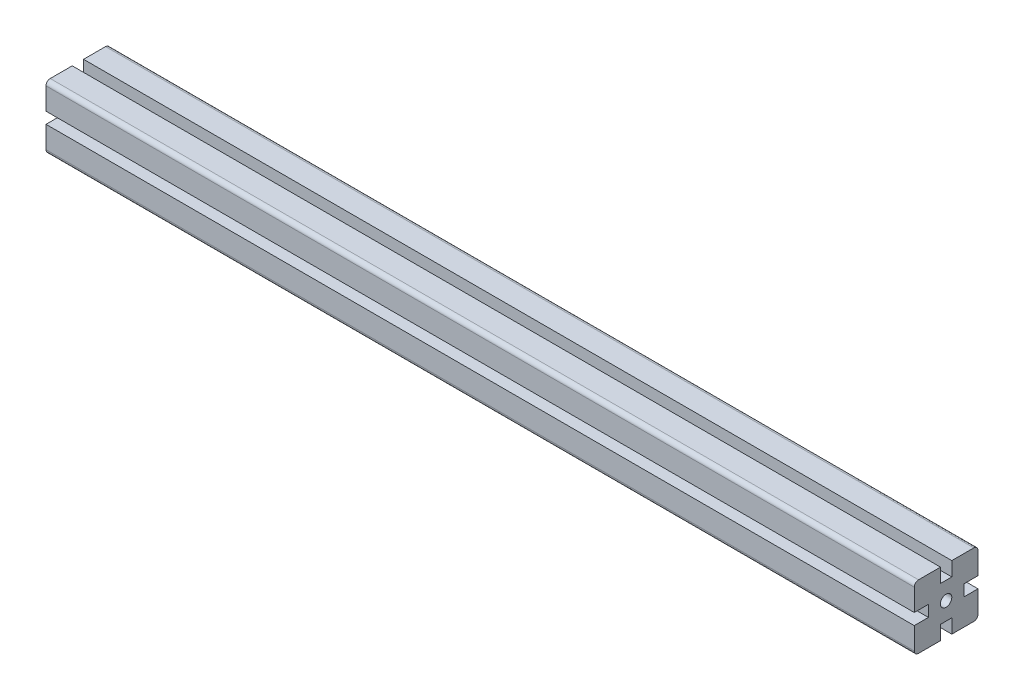
ISO-10303-21;
HEADER;
FILE_DESCRIPTION(('STEP AP214'),'2;1');
FILE_NAME('part.step','',(''),(''),'','','');
FILE_SCHEMA(('AUTOMOTIVE_DESIGN { 1 0 10303 214 1 1 1 1 }'));
ENDSEC;
DATA;
#1=APPLICATION_CONTEXT('core data for automotive mechanical design processes');
#2=APPLICATION_PROTOCOL_DEFINITION('international standard','automotive_design',2000,#1);
#3=PRODUCT_CONTEXT('',#1,'mechanical');
#4=PRODUCT('Part','Part','',(#3));
#5=PRODUCT_RELATED_PRODUCT_CATEGORY('part','',(#4));
#6=PRODUCT_DEFINITION_FORMATION('','',#4);
#7=PRODUCT_DEFINITION_CONTEXT('part definition',#1,'design');
#8=PRODUCT_DEFINITION('design','',#6,#7);
#9=PRODUCT_DEFINITION_SHAPE('','',#8);
#10=(LENGTH_UNIT() NAMED_UNIT(*) SI_UNIT(.MILLI.,.METRE.));
#11=(NAMED_UNIT(*) PLANE_ANGLE_UNIT() SI_UNIT($,.RADIAN.));
#12=(NAMED_UNIT(*) SI_UNIT($,.STERADIAN.) SOLID_ANGLE_UNIT());
#13=UNCERTAINTY_MEASURE_WITH_UNIT(LENGTH_MEASURE(1.E-05),#10,'distance_accuracy_value','');
#14=(GEOMETRIC_REPRESENTATION_CONTEXT(3) GLOBAL_UNCERTAINTY_ASSIGNED_CONTEXT((#13)) GLOBAL_UNIT_ASSIGNED_CONTEXT((#10,
#11,#12)) REPRESENTATION_CONTEXT('',''));
#15=CARTESIAN_POINT('',(0.,0.,0.));
#16=DIRECTION('',(0.,0.,1.));
#17=DIRECTION('',(1.,0.,0.));
#18=AXIS2_PLACEMENT_3D('',#15,#16,#17);
#19=CARTESIAN_POINT('',(387.,-22.5,-22.5));
#20=DIRECTION('',(0.,0.,-1.));
#21=DIRECTION('',(0.,1.,0.));
#22=AXIS2_PLACEMENT_3D('',#19,#20,#21);
#23=PLANE('',#22);
#24=DIRECTION('',(0.,1.,0.));
#25=VECTOR('',#24,1.);
#26=CARTESIAN_POINT('',(1000.,-22.5,-22.5));
#27=LINE('',#26,#25);
#28=CARTESIAN_POINT('',(1000.,-19.5,-22.5));
#29=VERTEX_POINT('',#28);
#30=CARTESIAN_POINT('',(1000.,-4.,-22.5));
#31=VERTEX_POINT('',#30);
#32=EDGE_CURVE('E269',#29,#31,#27,.T.);
#33=ORIENTED_EDGE('',*,*,#32,.F.);
#34=DIRECTION('',(1.,0.,0.));
#35=VECTOR('',#34,1.);
#36=CARTESIAN_POINT('',(387.,-19.5,-22.5));
#37=LINE('',#36,#35);
#38=CARTESIAN_POINT('',(387.,-19.5,-22.5));
#39=VERTEX_POINT('',#38);
#40=EDGE_CURVE('E200',#29,#39,#37,.F.);
#41=ORIENTED_EDGE('',*,*,#40,.T.);
#42=DIRECTION('',(0.,1.,0.));
#43=VECTOR('',#42,1.);
#44=CARTESIAN_POINT('',(387.,-22.5,-22.5));
#45=LINE('',#44,#43);
#46=CARTESIAN_POINT('',(387.,-4.,-22.5));
#47=VERTEX_POINT('',#46);
#48=EDGE_CURVE('E194',#39,#47,#45,.T.);
#49=ORIENTED_EDGE('',*,*,#48,.T.);
#50=DIRECTION('',(1.,0.,0.));
#51=VECTOR('',#50,1.);
#52=CARTESIAN_POINT('',(387.,-4.,-22.5));
#53=LINE('',#52,#51);
#54=EDGE_CURVE('E197',#47,#31,#53,.T.);
#55=ORIENTED_EDGE('',*,*,#54,.T.);
#56=EDGE_LOOP('',(#33,#41,#49,#55));
#57=FACE_BOUND('',#56,.T.);
#58=ADVANCED_FACE('F33',(#57),#23,.T.);
#59=CARTESIAN_POINT('',(387.,-22.5,-4.00000000000001));
#60=DIRECTION('',(0.,-1.,0.));
#61=DIRECTION('',(0.,0.,-1.));
#62=AXIS2_PLACEMENT_3D('',#59,#60,#61);
#63=PLANE('',#62);
#64=DIRECTION('',(0.,0.,-1.));
#65=VECTOR('',#64,1.);
#66=CARTESIAN_POINT('',(387.,-22.5,-4.00000000000001));
#67=LINE('',#66,#65);
#68=CARTESIAN_POINT('',(387.,-22.5,-4.00000000000001));
#69=VERTEX_POINT('',#68);
#70=CARTESIAN_POINT('',(387.,-22.5,-19.5));
#71=VERTEX_POINT('',#70);
#72=EDGE_CURVE('E212',#69,#71,#67,.T.);
#73=ORIENTED_EDGE('',*,*,#72,.T.);
#74=DIRECTION('',(1.,0.,0.));
#75=VECTOR('',#74,1.);
#76=CARTESIAN_POINT('',(387.,-22.5,-19.5));
#77=LINE('',#76,#75);
#78=CARTESIAN_POINT('',(1000.,-22.5,-19.5));
#79=VERTEX_POINT('',#78);
#80=EDGE_CURVE('E325',#71,#79,#77,.T.);
#81=ORIENTED_EDGE('',*,*,#80,.T.);
#82=DIRECTION('',(0.,0.,-1.));
#83=VECTOR('',#82,1.);
#84=CARTESIAN_POINT('',(1000.,-22.5,-4.00000000000001));
#85=LINE('',#84,#83);
#86=CARTESIAN_POINT('',(1000.,-22.5,-4.00000000000001));
#87=VERTEX_POINT('',#86);
#88=EDGE_CURVE('E204',#87,#79,#85,.T.);
#89=ORIENTED_EDGE('',*,*,#88,.F.);
#90=DIRECTION('',(1.,0.,0.));
#91=VECTOR('',#90,1.);
#92=CARTESIAN_POINT('',(387.,-22.5,-4.00000000000001));
#93=LINE('',#92,#91);
#94=EDGE_CURVE('E323',#69,#87,#93,.T.);
#95=ORIENTED_EDGE('',*,*,#94,.F.);
#96=EDGE_LOOP('',(#73,#81,#89,#95));
#97=FACE_BOUND('',#96,.T.);
#98=ADVANCED_FACE('F403',(#97),#63,.T.);
#99=CARTESIAN_POINT('',(387.,-12.5,-4.));
#100=DIRECTION('',(0.,0.,1.));
#101=DIRECTION('',(0.,-1.,0.));
#102=AXIS2_PLACEMENT_3D('',#99,#100,#101);
#103=PLANE('',#102);
#104=DIRECTION('',(0.,-1.,0.));
#105=VECTOR('',#104,1.);
#106=CARTESIAN_POINT('',(1000.,-12.5,-4.));
#107=LINE('',#106,#105);
#108=CARTESIAN_POINT('',(1000.,-12.5,-4.));
#109=VERTEX_POINT('',#108);
#110=EDGE_CURVE('E318',#109,#87,#107,.T.);
#111=ORIENTED_EDGE('',*,*,#110,.F.);
#112=DIRECTION('',(1.,0.,0.));
#113=VECTOR('',#112,1.);
#114=CARTESIAN_POINT('',(387.,-12.5,-4.));
#115=LINE('',#114,#113);
#116=CARTESIAN_POINT('',(387.,-12.5,-4.));
#117=VERTEX_POINT('',#116);
#118=EDGE_CURVE('E326',#117,#109,#115,.T.);
#119=ORIENTED_EDGE('',*,*,#118,.F.);
#120=DIRECTION('',(0.,-1.,0.));
#121=VECTOR('',#120,1.);
#122=CARTESIAN_POINT('',(387.,-12.5,-4.));
#123=LINE('',#122,#121);
#124=EDGE_CURVE('E264',#117,#69,#123,.T.);
#125=ORIENTED_EDGE('',*,*,#124,.T.);
#126=ORIENTED_EDGE('',*,*,#94,.T.);
#127=EDGE_LOOP('',(#111,#119,#125,#126));
#128=FACE_BOUND('',#127,.T.);
#129=ADVANCED_FACE('F407',(#128),#103,.T.);
#130=CARTESIAN_POINT('',(387.,-12.5,4.));
#131=DIRECTION('',(0.,-1.,0.));
#132=DIRECTION('',(0.,0.,-1.));
#133=AXIS2_PLACEMENT_3D('',#130,#131,#132);
#134=PLANE('',#133);
#135=DIRECTION('',(0.,0.,-1.));
#136=VECTOR('',#135,1.);
#137=CARTESIAN_POINT('',(1000.,-12.5,4.));
#138=LINE('',#137,#136);
#139=CARTESIAN_POINT('',(1000.,-12.5,4.));
#140=VERTEX_POINT('',#139);
#141=EDGE_CURVE('E315',#140,#109,#138,.T.);
#142=ORIENTED_EDGE('',*,*,#141,.F.);
#143=DIRECTION('',(1.,0.,0.));
#144=VECTOR('',#143,1.);
#145=CARTESIAN_POINT('',(387.,-12.5,4.));
#146=LINE('',#145,#144);
#147=CARTESIAN_POINT('',(387.,-12.5,4.));
#148=VERTEX_POINT('',#147);
#149=EDGE_CURVE('E328',#148,#140,#146,.T.);
#150=ORIENTED_EDGE('',*,*,#149,.F.);
#151=DIRECTION('',(0.,0.,-1.));
#152=VECTOR('',#151,1.);
#153=CARTESIAN_POINT('',(387.,-12.5,4.));
#154=LINE('',#153,#152);
#155=EDGE_CURVE('E261',#148,#117,#154,.T.);
#156=ORIENTED_EDGE('',*,*,#155,.T.);
#157=ORIENTED_EDGE('',*,*,#118,.T.);
#158=EDGE_LOOP('',(#142,#150,#156,#157));
#159=FACE_BOUND('',#158,.T.);
#160=ADVANCED_FACE('F412',(#159),#134,.T.);
#161=CARTESIAN_POINT('',(387.,-22.5,4.00000000000001));
#162=DIRECTION('',(0.,0.,-1.));
#163=DIRECTION('',(0.,1.,0.));
#164=AXIS2_PLACEMENT_3D('',#161,#162,#163);
#165=PLANE('',#164);
#166=DIRECTION('',(0.,1.,0.));
#167=VECTOR('',#166,1.);
#168=CARTESIAN_POINT('',(1000.,-22.5,4.00000000000001));
#169=LINE('',#168,#167);
#170=CARTESIAN_POINT('',(1000.,-22.5,4.00000000000001));
#171=VERTEX_POINT('',#170);
#172=EDGE_CURVE('E312',#171,#140,#169,.T.);
#173=ORIENTED_EDGE('',*,*,#172,.F.);
#174=DIRECTION('',(1.,0.,0.));
#175=VECTOR('',#174,1.);
#176=CARTESIAN_POINT('',(387.,-22.5,4.00000000000001));
#177=LINE('',#176,#175);
#178=CARTESIAN_POINT('',(387.,-22.5,4.00000000000001));
#179=VERTEX_POINT('',#178);
#180=EDGE_CURVE('E330',#179,#171,#177,.T.);
#181=ORIENTED_EDGE('',*,*,#180,.F.);
#182=DIRECTION('',(0.,1.,0.));
#183=VECTOR('',#182,1.);
#184=CARTESIAN_POINT('',(387.,-22.5,4.00000000000001));
#185=LINE('',#184,#183);
#186=EDGE_CURVE('E258',#179,#148,#185,.T.);
#187=ORIENTED_EDGE('',*,*,#186,.T.);
#188=ORIENTED_EDGE('',*,*,#149,.T.);
#189=EDGE_LOOP('',(#173,#181,#187,#188));
#190=FACE_BOUND('',#189,.T.);
#191=ADVANCED_FACE('F415',(#190),#165,.T.);
#192=CARTESIAN_POINT('',(387.,-22.5,22.5));
#193=DIRECTION('',(0.,-1.,0.));
#194=DIRECTION('',(0.,0.,-1.));
#195=AXIS2_PLACEMENT_3D('',#192,#193,#194);
#196=PLANE('',#195);
#197=DIRECTION('',(0.,0.,-1.));
#198=VECTOR('',#197,1.);
#199=CARTESIAN_POINT('',(1000.,-22.5,22.5));
#200=LINE('',#199,#198);
#201=CARTESIAN_POINT('',(1000.,-22.5,19.5));
#202=VERTEX_POINT('',#201);
#203=EDGE_CURVE('E310',#202,#171,#200,.T.);
#204=ORIENTED_EDGE('',*,*,#203,.F.);
#205=DIRECTION('',(1.,0.,0.));
#206=VECTOR('',#205,1.);
#207=CARTESIAN_POINT('',(387.,-22.5,19.5));
#208=LINE('',#207,#206);
#209=CARTESIAN_POINT('',(387.,-22.5,19.5));
#210=VERTEX_POINT('',#209);
#211=EDGE_CURVE('E377',#202,#210,#208,.F.);
#212=ORIENTED_EDGE('',*,*,#211,.T.);
#213=DIRECTION('',(0.,0.,-1.));
#214=VECTOR('',#213,1.);
#215=CARTESIAN_POINT('',(387.,-22.5,22.5));
#216=LINE('',#215,#214);
#217=EDGE_CURVE('E256',#210,#179,#216,.T.);
#218=ORIENTED_EDGE('',*,*,#217,.T.);
#219=ORIENTED_EDGE('',*,*,#180,.T.);
#220=EDGE_LOOP('',(#204,#212,#218,#219));
#221=FACE_BOUND('',#220,.T.);
#222=ADVANCED_FACE('F628',(#221),#196,.T.);
#223=CARTESIAN_POINT('',(387.,-4.,22.5));
#224=DIRECTION('',(0.,0.,1.));
#225=DIRECTION('',(0.,-1.,0.));
#226=AXIS2_PLACEMENT_3D('',#223,#224,#225);
#227=PLANE('',#226);
#228=DIRECTION('',(0.,-1.,0.));
#229=VECTOR('',#228,1.);
#230=CARTESIAN_POINT('',(387.,-4.,22.5));
#231=LINE('',#230,#229);
#232=CARTESIAN_POINT('',(387.,-4.,22.5));
#233=VERTEX_POINT('',#232);
#234=CARTESIAN_POINT('',(387.,-19.5,22.5));
#235=VERTEX_POINT('',#234);
#236=EDGE_CURVE('E253',#233,#235,#231,.T.);
#237=ORIENTED_EDGE('',*,*,#236,.T.);
#238=DIRECTION('',(1.,0.,0.));
#239=VECTOR('',#238,1.);
#240=CARTESIAN_POINT('',(387.,-19.5,22.5));
#241=LINE('',#240,#239);
#242=CARTESIAN_POINT('',(1000.,-19.5,22.5));
#243=VERTEX_POINT('',#242);
#244=EDGE_CURVE('E374',#235,#243,#241,.T.);
#245=ORIENTED_EDGE('',*,*,#244,.T.);
#246=DIRECTION('',(0.,-1.,0.));
#247=VECTOR('',#246,1.);
#248=CARTESIAN_POINT('',(1000.,-4.,22.5));
#249=LINE('',#248,#247);
#250=CARTESIAN_POINT('',(1000.,-4.,22.5));
#251=VERTEX_POINT('',#250);
#252=EDGE_CURVE('E307',#251,#243,#249,.T.);
#253=ORIENTED_EDGE('',*,*,#252,.F.);
#254=DIRECTION('',(1.,0.,0.));
#255=VECTOR('',#254,1.);
#256=CARTESIAN_POINT('',(387.,-4.,22.5));
#257=LINE('',#256,#255);
#258=EDGE_CURVE('E333',#233,#251,#257,.T.);
#259=ORIENTED_EDGE('',*,*,#258,.F.);
#260=EDGE_LOOP('',(#237,#245,#253,#259));
#261=FACE_BOUND('',#260,.T.);
#262=ADVANCED_FACE('F427',(#261),#227,.T.);
#263=CARTESIAN_POINT('',(387.,-4.,12.5));
#264=DIRECTION('',(0.,1.,0.));
#265=DIRECTION('',(0.,0.,1.));
#266=AXIS2_PLACEMENT_3D('',#263,#264,#265);
#267=PLANE('',#266);
#268=DIRECTION('',(0.,0.,1.));
#269=VECTOR('',#268,1.);
#270=CARTESIAN_POINT('',(1000.,-4.,12.5));
#271=LINE('',#270,#269);
#272=CARTESIAN_POINT('',(1000.,-4.,12.5));
#273=VERTEX_POINT('',#272);
#274=EDGE_CURVE('E304',#273,#251,#271,.T.);
#275=ORIENTED_EDGE('',*,*,#274,.F.);
#276=DIRECTION('',(1.,0.,0.));
#277=VECTOR('',#276,1.);
#278=CARTESIAN_POINT('',(387.,-4.,12.5));
#279=LINE('',#278,#277);
#280=CARTESIAN_POINT('',(387.,-4.,12.5));
#281=VERTEX_POINT('',#280);
#282=EDGE_CURVE('E335',#281,#273,#279,.T.);
#283=ORIENTED_EDGE('',*,*,#282,.F.);
#284=DIRECTION('',(0.,0.,1.));
#285=VECTOR('',#284,1.);
#286=CARTESIAN_POINT('',(387.,-4.,12.5));
#287=LINE('',#286,#285);
#288=EDGE_CURVE('E250',#281,#233,#287,.T.);
#289=ORIENTED_EDGE('',*,*,#288,.T.);
#290=ORIENTED_EDGE('',*,*,#258,.T.);
#291=EDGE_LOOP('',(#275,#283,#289,#290));
#292=FACE_BOUND('',#291,.T.);
#293=ADVANCED_FACE('F432',(#292),#267,.T.);
#294=CARTESIAN_POINT('',(387.,4.,12.5));
#295=DIRECTION('',(0.,0.,1.));
#296=DIRECTION('',(1.,0.,0.));
#297=AXIS2_PLACEMENT_3D('',#294,#295,#296);
#298=PLANE('',#297);
#299=DIRECTION('',(0.,-1.,0.));
#300=VECTOR('',#299,1.);
#301=CARTESIAN_POINT('',(1000.,4.,12.5));
#302=LINE('',#301,#300);
#303=CARTESIAN_POINT('',(1000.,4.,12.5));
#304=VERTEX_POINT('',#303);
#305=EDGE_CURVE('E301',#304,#273,#302,.T.);
#306=ORIENTED_EDGE('',*,*,#305,.F.);
#307=DIRECTION('',(1.,0.,0.));
#308=VECTOR('',#307,1.);
#309=CARTESIAN_POINT('',(387.,4.,12.5));
#310=LINE('',#309,#308);
#311=CARTESIAN_POINT('',(387.,4.,12.5));
#312=VERTEX_POINT('',#311);
#313=EDGE_CURVE('E337',#312,#304,#310,.T.);
#314=ORIENTED_EDGE('',*,*,#313,.F.);
#315=DIRECTION('',(0.,-1.,0.));
#316=VECTOR('',#315,1.);
#317=CARTESIAN_POINT('',(387.,4.,12.5));
#318=LINE('',#317,#316);
#319=EDGE_CURVE('E247',#312,#281,#318,.T.);
#320=ORIENTED_EDGE('',*,*,#319,.T.);
#321=ORIENTED_EDGE('',*,*,#282,.T.);
#322=EDGE_LOOP('',(#306,#314,#320,#321));
#323=FACE_BOUND('',#322,.T.);
#324=ADVANCED_FACE('F437',(#323),#298,.T.);
#325=CARTESIAN_POINT('',(387.,4.,22.5));
#326=DIRECTION('',(0.,-1.,0.));
#327=DIRECTION('',(0.,0.,-1.));
#328=AXIS2_PLACEMENT_3D('',#325,#326,#327);
#329=PLANE('',#328);
#330=DIRECTION('',(0.,0.,-1.));
#331=VECTOR('',#330,1.);
#332=CARTESIAN_POINT('',(1000.,4.,22.5));
#333=LINE('',#332,#331);
#334=CARTESIAN_POINT('',(1000.,4.,22.5));
#335=VERTEX_POINT('',#334);
#336=EDGE_CURVE('E298',#335,#304,#333,.T.);
#337=ORIENTED_EDGE('',*,*,#336,.F.);
#338=DIRECTION('',(1.,0.,0.));
#339=VECTOR('',#338,1.);
#340=CARTESIAN_POINT('',(387.,4.,22.5));
#341=LINE('',#340,#339);
#342=CARTESIAN_POINT('',(387.,4.,22.5));
#343=VERTEX_POINT('',#342);
#344=EDGE_CURVE('E339',#343,#335,#341,.T.);
#345=ORIENTED_EDGE('',*,*,#344,.F.);
#346=DIRECTION('',(0.,0.,-1.));
#347=VECTOR('',#346,1.);
#348=CARTESIAN_POINT('',(387.,4.,22.5));
#349=LINE('',#348,#347);
#350=EDGE_CURVE('E244',#343,#312,#349,.T.);
#351=ORIENTED_EDGE('',*,*,#350,.T.);
#352=ORIENTED_EDGE('',*,*,#313,.T.);
#353=EDGE_LOOP('',(#337,#345,#351,#352));
#354=FACE_BOUND('',#353,.T.);
#355=ADVANCED_FACE('F440',(#354),#329,.T.);
#356=CARTESIAN_POINT('',(387.,22.5,22.5));
#357=DIRECTION('',(0.,0.,1.));
#358=DIRECTION('',(0.,-1.,0.));
#359=AXIS2_PLACEMENT_3D('',#356,#357,#358);
#360=PLANE('',#359);
#361=DIRECTION('',(0.,-1.,0.));
#362=VECTOR('',#361,1.);
#363=CARTESIAN_POINT('',(1000.,22.5,22.5));
#364=LINE('',#363,#362);
#365=CARTESIAN_POINT('',(1000.,19.5,22.5));
#366=VERTEX_POINT('',#365);
#367=EDGE_CURVE('E296',#366,#335,#364,.T.);
#368=ORIENTED_EDGE('',*,*,#367,.F.);
#369=DIRECTION('',(1.,0.,0.));
#370=VECTOR('',#369,1.);
#371=CARTESIAN_POINT('',(387.,19.5,22.5));
#372=LINE('',#371,#370);
#373=CARTESIAN_POINT('',(387.,19.5,22.5));
#374=VERTEX_POINT('',#373);
#375=EDGE_CURVE('E382',#366,#374,#372,.F.);
#376=ORIENTED_EDGE('',*,*,#375,.T.);
#377=DIRECTION('',(0.,-1.,0.));
#378=VECTOR('',#377,1.);
#379=CARTESIAN_POINT('',(387.,22.5,22.5));
#380=LINE('',#379,#378);
#381=EDGE_CURVE('E242',#374,#343,#380,.T.);
#382=ORIENTED_EDGE('',*,*,#381,.T.);
#383=ORIENTED_EDGE('',*,*,#344,.T.);
#384=EDGE_LOOP('',(#368,#376,#382,#383));
#385=FACE_BOUND('',#384,.T.);
#386=ADVANCED_FACE('F592',(#385),#360,.T.);
#387=CARTESIAN_POINT('',(387.,22.5,4.));
#388=DIRECTION('',(0.,1.,0.));
#389=DIRECTION('',(0.,0.,1.));
#390=AXIS2_PLACEMENT_3D('',#387,#388,#389);
#391=PLANE('',#390);
#392=DIRECTION('',(0.,0.,1.));
#393=VECTOR('',#392,1.);
#394=CARTESIAN_POINT('',(387.,22.5,4.));
#395=LINE('',#394,#393);
#396=CARTESIAN_POINT('',(387.,22.5,4.));
#397=VERTEX_POINT('',#396);
#398=CARTESIAN_POINT('',(387.,22.5,19.5));
#399=VERTEX_POINT('',#398);
#400=EDGE_CURVE('E239',#397,#399,#395,.T.);
#401=ORIENTED_EDGE('',*,*,#400,.T.);
#402=DIRECTION('',(1.,0.,0.));
#403=VECTOR('',#402,1.);
#404=CARTESIAN_POINT('',(387.,22.5,19.5));
#405=LINE('',#404,#403);
#406=CARTESIAN_POINT('',(1000.,22.5,19.5));
#407=VERTEX_POINT('',#406);
#408=EDGE_CURVE('E379',#399,#407,#405,.T.);
#409=ORIENTED_EDGE('',*,*,#408,.T.);
#410=DIRECTION('',(0.,0.,1.));
#411=VECTOR('',#410,1.);
#412=CARTESIAN_POINT('',(1000.,22.5,4.));
#413=LINE('',#412,#411);
#414=CARTESIAN_POINT('',(1000.,22.5,4.));
#415=VERTEX_POINT('',#414);
#416=EDGE_CURVE('E293',#415,#407,#413,.T.);
#417=ORIENTED_EDGE('',*,*,#416,.F.);
#418=DIRECTION('',(1.,0.,0.));
#419=VECTOR('',#418,1.);
#420=CARTESIAN_POINT('',(387.,22.5,4.));
#421=LINE('',#420,#419);
#422=EDGE_CURVE('E342',#397,#415,#421,.T.);
#423=ORIENTED_EDGE('',*,*,#422,.F.);
#424=EDGE_LOOP('',(#401,#409,#417,#423));
#425=FACE_BOUND('',#424,.T.);
#426=ADVANCED_FACE('F452',(#425),#391,.T.);
#427=CARTESIAN_POINT('',(387.,12.5,4.));
#428=DIRECTION('',(0.,0.,-1.));
#429=DIRECTION('',(0.,1.,0.));
#430=AXIS2_PLACEMENT_3D('',#427,#428,#429);
#431=PLANE('',#430);
#432=DIRECTION('',(0.,1.,0.));
#433=VECTOR('',#432,1.);
#434=CARTESIAN_POINT('',(1000.,12.5,4.));
#435=LINE('',#434,#433);
#436=CARTESIAN_POINT('',(1000.,12.5,4.));
#437=VERTEX_POINT('',#436);
#438=EDGE_CURVE('E290',#437,#415,#435,.T.);
#439=ORIENTED_EDGE('',*,*,#438,.F.);
#440=DIRECTION('',(1.,0.,0.));
#441=VECTOR('',#440,1.);
#442=CARTESIAN_POINT('',(387.,12.5,4.));
#443=LINE('',#442,#441);
#444=CARTESIAN_POINT('',(387.,12.5,4.));
#445=VERTEX_POINT('',#444);
#446=EDGE_CURVE('E344',#445,#437,#443,.T.);
#447=ORIENTED_EDGE('',*,*,#446,.F.);
#448=DIRECTION('',(0.,1.,0.));
#449=VECTOR('',#448,1.);
#450=CARTESIAN_POINT('',(387.,12.5,4.));
#451=LINE('',#450,#449);
#452=EDGE_CURVE('E236',#445,#397,#451,.T.);
#453=ORIENTED_EDGE('',*,*,#452,.T.);
#454=ORIENTED_EDGE('',*,*,#422,.T.);
#455=EDGE_LOOP('',(#439,#447,#453,#454));
#456=FACE_BOUND('',#455,.T.);
#457=ADVANCED_FACE('F457',(#456),#431,.T.);
#458=CARTESIAN_POINT('',(387.,12.5,-4.));
#459=DIRECTION('',(0.,1.,0.));
#460=DIRECTION('',(0.,0.,1.));
#461=AXIS2_PLACEMENT_3D('',#458,#459,#460);
#462=PLANE('',#461);
#463=DIRECTION('',(0.,0.,1.));
#464=VECTOR('',#463,1.);
#465=CARTESIAN_POINT('',(1000.,12.5,-4.));
#466=LINE('',#465,#464);
#467=CARTESIAN_POINT('',(1000.,12.5,-4.));
#468=VERTEX_POINT('',#467);
#469=EDGE_CURVE('E287',#468,#437,#466,.T.);
#470=ORIENTED_EDGE('',*,*,#469,.F.);
#471=DIRECTION('',(1.,0.,0.));
#472=VECTOR('',#471,1.);
#473=CARTESIAN_POINT('',(387.,12.5,-4.));
#474=LINE('',#473,#472);
#475=CARTESIAN_POINT('',(387.,12.5,-4.));
#476=VERTEX_POINT('',#475);
#477=EDGE_CURVE('E346',#476,#468,#474,.T.);
#478=ORIENTED_EDGE('',*,*,#477,.F.);
#479=DIRECTION('',(0.,0.,1.));
#480=VECTOR('',#479,1.);
#481=CARTESIAN_POINT('',(387.,12.5,-4.));
#482=LINE('',#481,#480);
#483=EDGE_CURVE('E233',#476,#445,#482,.T.);
#484=ORIENTED_EDGE('',*,*,#483,.T.);
#485=ORIENTED_EDGE('',*,*,#446,.T.);
#486=EDGE_LOOP('',(#470,#478,#484,#485));
#487=FACE_BOUND('',#486,.T.);
#488=ADVANCED_FACE('F462',(#487),#462,.T.);
#489=CARTESIAN_POINT('',(387.,22.5,-4.));
#490=DIRECTION('',(0.,0.,1.));
#491=DIRECTION('',(0.,-1.,0.));
#492=AXIS2_PLACEMENT_3D('',#489,#490,#491);
#493=PLANE('',#492);
#494=DIRECTION('',(0.,-1.,0.));
#495=VECTOR('',#494,1.);
#496=CARTESIAN_POINT('',(1000.,22.5,-4.));
#497=LINE('',#496,#495);
#498=CARTESIAN_POINT('',(1000.,22.5,-4.));
#499=VERTEX_POINT('',#498);
#500=EDGE_CURVE('E284',#499,#468,#497,.T.);
#501=ORIENTED_EDGE('',*,*,#500,.F.);
#502=DIRECTION('',(1.,0.,0.));
#503=VECTOR('',#502,1.);
#504=CARTESIAN_POINT('',(387.,22.5,-4.));
#505=LINE('',#504,#503);
#506=CARTESIAN_POINT('',(387.,22.5,-4.));
#507=VERTEX_POINT('',#506);
#508=EDGE_CURVE('E348',#507,#499,#505,.T.);
#509=ORIENTED_EDGE('',*,*,#508,.F.);
#510=DIRECTION('',(0.,-1.,0.));
#511=VECTOR('',#510,1.);
#512=CARTESIAN_POINT('',(387.,22.5,-4.));
#513=LINE('',#512,#511);
#514=EDGE_CURVE('E230',#507,#476,#513,.T.);
#515=ORIENTED_EDGE('',*,*,#514,.T.);
#516=ORIENTED_EDGE('',*,*,#477,.T.);
#517=EDGE_LOOP('',(#501,#509,#515,#516));
#518=FACE_BOUND('',#517,.T.);
#519=ADVANCED_FACE('F465',(#518),#493,.T.);
#520=CARTESIAN_POINT('',(387.,22.5,-22.5));
#521=DIRECTION('',(0.,1.,0.));
#522=DIRECTION('',(0.,0.,1.));
#523=AXIS2_PLACEMENT_3D('',#520,#521,#522);
#524=PLANE('',#523);
#525=DIRECTION('',(0.,0.,1.));
#526=VECTOR('',#525,1.);
#527=CARTESIAN_POINT('',(1000.,22.5,-22.5));
#528=LINE('',#527,#526);
#529=CARTESIAN_POINT('',(1000.,22.5,-19.5));
#530=VERTEX_POINT('',#529);
#531=EDGE_CURVE('E282',#530,#499,#528,.T.);
#532=ORIENTED_EDGE('',*,*,#531,.F.);
#533=DIRECTION('',(1.,0.,0.));
#534=VECTOR('',#533,1.);
#535=CARTESIAN_POINT('',(387.,22.5,-19.5));
#536=LINE('',#535,#534);
#537=CARTESIAN_POINT('',(387.,22.5,-19.5));
#538=VERTEX_POINT('',#537);
#539=EDGE_CURVE('E11',#530,#538,#536,.F.);
#540=ORIENTED_EDGE('',*,*,#539,.T.);
#541=DIRECTION('',(0.,0.,1.));
#542=VECTOR('',#541,1.);
#543=CARTESIAN_POINT('',(387.,22.5,-22.5));
#544=LINE('',#543,#542);
#545=EDGE_CURVE('E228',#538,#507,#544,.T.);
#546=ORIENTED_EDGE('',*,*,#545,.T.);
#547=ORIENTED_EDGE('',*,*,#508,.T.);
#548=EDGE_LOOP('',(#532,#540,#546,#547));
#549=FACE_BOUND('',#548,.T.);
#550=ADVANCED_FACE('F556',(#549),#524,.T.);
#551=CARTESIAN_POINT('',(387.,4.,-22.5));
#552=DIRECTION('',(0.,0.,-1.));
#553=DIRECTION('',(0.,1.,0.));
#554=AXIS2_PLACEMENT_3D('',#551,#552,#553);
#555=PLANE('',#554);
#556=DIRECTION('',(0.,1.,0.));
#557=VECTOR('',#556,1.);
#558=CARTESIAN_POINT('',(387.,4.,-22.5));
#559=LINE('',#558,#557);
#560=CARTESIAN_POINT('',(387.,4.,-22.5));
#561=VERTEX_POINT('',#560);
#562=CARTESIAN_POINT('',(387.,19.5,-22.5));
#563=VERTEX_POINT('',#562);
#564=EDGE_CURVE('E226',#561,#563,#559,.T.);
#565=ORIENTED_EDGE('',*,*,#564,.T.);
#566=DIRECTION('',(1.,0.,0.));
#567=VECTOR('',#566,1.);
#568=CARTESIAN_POINT('',(387.,19.5,-22.5));
#569=LINE('',#568,#567);
#570=CARTESIAN_POINT('',(1000.,19.5,-22.5));
#571=VERTEX_POINT('',#570);
#572=EDGE_CURVE('E41',#563,#571,#569,.T.);
#573=ORIENTED_EDGE('',*,*,#572,.T.);
#574=DIRECTION('',(0.,1.,0.));
#575=VECTOR('',#574,1.);
#576=CARTESIAN_POINT('',(1000.,4.,-22.5));
#577=LINE('',#576,#575);
#578=CARTESIAN_POINT('',(1000.,4.,-22.5));
#579=VERTEX_POINT('',#578);
#580=EDGE_CURVE('E279',#579,#571,#577,.T.);
#581=ORIENTED_EDGE('',*,*,#580,.F.);
#582=DIRECTION('',(1.,0.,0.));
#583=VECTOR('',#582,1.);
#584=CARTESIAN_POINT('',(387.,4.,-22.5));
#585=LINE('',#584,#583);
#586=EDGE_CURVE('E351',#561,#579,#585,.T.);
#587=ORIENTED_EDGE('',*,*,#586,.F.);
#588=EDGE_LOOP('',(#565,#573,#581,#587));
#589=FACE_BOUND('',#588,.T.);
#590=ADVANCED_FACE('F387',(#589),#555,.T.);
#591=CARTESIAN_POINT('',(387.,4.,-12.5));
#592=DIRECTION('',(0.,-1.,0.));
#593=DIRECTION('',(0.,0.,-1.));
#594=AXIS2_PLACEMENT_3D('',#591,#592,#593);
#595=PLANE('',#594);
#596=DIRECTION('',(0.,0.,-1.));
#597=VECTOR('',#596,1.);
#598=CARTESIAN_POINT('',(1000.,4.,-12.5));
#599=LINE('',#598,#597);
#600=CARTESIAN_POINT('',(1000.,4.,-12.5));
#601=VERTEX_POINT('',#600);
#602=EDGE_CURVE('E276',#601,#579,#599,.T.);
#603=ORIENTED_EDGE('',*,*,#602,.F.);
#604=DIRECTION('',(1.,0.,0.));
#605=VECTOR('',#604,1.);
#606=CARTESIAN_POINT('',(387.,4.,-12.5));
#607=LINE('',#606,#605);
#608=CARTESIAN_POINT('',(387.,4.,-12.5));
#609=VERTEX_POINT('',#608);
#610=EDGE_CURVE('E353',#609,#601,#607,.T.);
#611=ORIENTED_EDGE('',*,*,#610,.F.);
#612=DIRECTION('',(0.,0.,-1.));
#613=VECTOR('',#612,1.);
#614=CARTESIAN_POINT('',(387.,4.,-12.5));
#615=LINE('',#614,#613);
#616=EDGE_CURVE('E220',#609,#561,#615,.T.);
#617=ORIENTED_EDGE('',*,*,#616,.T.);
#618=ORIENTED_EDGE('',*,*,#586,.T.);
#619=EDGE_LOOP('',(#603,#611,#617,#618));
#620=FACE_BOUND('',#619,.T.);
#621=ADVANCED_FACE('F394',(#620),#595,.T.);
#622=CARTESIAN_POINT('',(387.,-4.,-12.5));
#623=DIRECTION('',(0.,0.,-1.));
#624=DIRECTION('',(-1.,0.,0.));
#625=AXIS2_PLACEMENT_3D('',#622,#623,#624);
#626=PLANE('',#625);
#627=DIRECTION('',(0.,1.,0.));
#628=VECTOR('',#627,1.);
#629=CARTESIAN_POINT('',(1000.,-4.,-12.5));
#630=LINE('',#629,#628);
#631=CARTESIAN_POINT('',(1000.,-4.,-12.5));
#632=VERTEX_POINT('',#631);
#633=EDGE_CURVE('E273',#632,#601,#630,.T.);
#634=ORIENTED_EDGE('',*,*,#633,.F.);
#635=DIRECTION('',(1.,0.,0.));
#636=VECTOR('',#635,1.);
#637=CARTESIAN_POINT('',(387.,-4.,-12.5));
#638=LINE('',#637,#636);
#639=CARTESIAN_POINT('',(387.,-4.,-12.5));
#640=VERTEX_POINT('',#639);
#641=EDGE_CURVE('E211',#640,#632,#638,.T.);
#642=ORIENTED_EDGE('',*,*,#641,.F.);
#643=DIRECTION('',(0.,1.,0.));
#644=VECTOR('',#643,1.);
#645=CARTESIAN_POINT('',(387.,-4.,-12.5));
#646=LINE('',#645,#644);
#647=EDGE_CURVE('E218',#640,#609,#646,.T.);
#648=ORIENTED_EDGE('',*,*,#647,.T.);
#649=ORIENTED_EDGE('',*,*,#610,.T.);
#650=EDGE_LOOP('',(#634,#642,#648,#649));
#651=FACE_BOUND('',#650,.T.);
#652=ADVANCED_FACE('F396',(#651),#626,.T.);
#653=CARTESIAN_POINT('',(387.,-4.,-22.5));
#654=DIRECTION('',(0.,1.,0.));
#655=DIRECTION('',(0.,0.,1.));
#656=AXIS2_PLACEMENT_3D('',#653,#654,#655);
#657=PLANE('',#656);
#658=DIRECTION('',(0.,0.,1.));
#659=VECTOR('',#658,1.);
#660=CARTESIAN_POINT('',(1000.,-4.,-22.5));
#661=LINE('',#660,#659);
#662=EDGE_CURVE('E210',#31,#632,#661,.T.);
#663=ORIENTED_EDGE('',*,*,#662,.F.);
#664=ORIENTED_EDGE('',*,*,#54,.F.);
#665=DIRECTION('',(0.,0.,1.));
#666=VECTOR('',#665,1.);
#667=CARTESIAN_POINT('',(387.,-4.,-22.5));
#668=LINE('',#667,#666);
#669=EDGE_CURVE('E203',#47,#640,#668,.T.);
#670=ORIENTED_EDGE('',*,*,#669,.T.);
#671=ORIENTED_EDGE('',*,*,#641,.T.);
#672=EDGE_LOOP('',(#663,#664,#670,#671));
#673=FACE_BOUND('',#672,.T.);
#674=ADVANCED_FACE('F208',(#673),#657,.T.);
#675=CARTESIAN_POINT('',(387.,0.,0.));
#676=DIRECTION('',(1.,0.,0.));
#677=DIRECTION('',(0.,0.,-1.));
#678=AXIS2_PLACEMENT_3D('',#675,#676,#677);
#679=PLANE('',#678);
#680=CARTESIAN_POINT('',(387.,0.,0.));
#681=DIRECTION('',(1.,0.,0.));
#682=DIRECTION('',(0.,0.,1.));
#683=AXIS2_PLACEMENT_3D('',#680,#681,#682);
#684=CIRCLE('',#683,4.);
#685=CARTESIAN_POINT('',(387.,0.,4.));
#686=VERTEX_POINT('',#685);
#687=EDGE_CURVE('E271',#686,#686,#684,.T.);
#688=ORIENTED_EDGE('',*,*,#687,.T.);
#689=EDGE_LOOP('',(#688));
#690=FACE_BOUND('',#689,.T.);
#691=ORIENTED_EDGE('',*,*,#48,.F.);
#692=CARTESIAN_POINT('',(387.,-19.5,-19.5));
#693=DIRECTION('',(1.,0.,0.));
#694=DIRECTION('',(0.,0.,-1.));
#695=AXIS2_PLACEMENT_3D('',#692,#693,#694);
#696=CIRCLE('',#695,3.);
#697=EDGE_CURVE('E372',#39,#71,#696,.F.);
#698=ORIENTED_EDGE('',*,*,#697,.T.);
#699=ORIENTED_EDGE('',*,*,#72,.F.);
#700=ORIENTED_EDGE('',*,*,#124,.F.);
#701=ORIENTED_EDGE('',*,*,#155,.F.);
#702=ORIENTED_EDGE('',*,*,#186,.F.);
#703=ORIENTED_EDGE('',*,*,#217,.F.);
#704=CARTESIAN_POINT('',(387.,-19.5,19.5));
#705=DIRECTION('',(1.,0.,0.));
#706=DIRECTION('',(0.,0.,-1.));
#707=AXIS2_PLACEMENT_3D('',#704,#705,#706);
#708=CIRCLE('',#707,3.);
#709=EDGE_CURVE('E370',#210,#235,#708,.F.);
#710=ORIENTED_EDGE('',*,*,#709,.T.);
#711=ORIENTED_EDGE('',*,*,#236,.F.);
#712=ORIENTED_EDGE('',*,*,#288,.F.);
#713=ORIENTED_EDGE('',*,*,#319,.F.);
#714=ORIENTED_EDGE('',*,*,#350,.F.);
#715=ORIENTED_EDGE('',*,*,#381,.F.);
#716=CARTESIAN_POINT('',(387.,19.5,19.5));
#717=DIRECTION('',(1.,0.,0.));
#718=DIRECTION('',(0.,0.,-1.));
#719=AXIS2_PLACEMENT_3D('',#716,#717,#718);
#720=CIRCLE('',#719,3.);
#721=EDGE_CURVE('E368',#374,#399,#720,.F.);
#722=ORIENTED_EDGE('',*,*,#721,.T.);
#723=ORIENTED_EDGE('',*,*,#400,.F.);
#724=ORIENTED_EDGE('',*,*,#452,.F.);
#725=ORIENTED_EDGE('',*,*,#483,.F.);
#726=ORIENTED_EDGE('',*,*,#514,.F.);
#727=ORIENTED_EDGE('',*,*,#545,.F.);
#728=CARTESIAN_POINT('',(387.,19.5,-19.5));
#729=DIRECTION('',(1.,0.,0.));
#730=DIRECTION('',(0.,0.,-1.));
#731=AXIS2_PLACEMENT_3D('',#728,#729,#730);
#732=CIRCLE('',#731,3.);
#733=EDGE_CURVE('E48',#538,#563,#732,.F.);
#734=ORIENTED_EDGE('',*,*,#733,.T.);
#735=ORIENTED_EDGE('',*,*,#564,.F.);
#736=ORIENTED_EDGE('',*,*,#616,.F.);
#737=ORIENTED_EDGE('',*,*,#647,.F.);
#738=ORIENTED_EDGE('',*,*,#669,.F.);
#739=EDGE_LOOP('',(#691,#698,#699,#700,#701,#702,#703,#710,#711,#712,#713,#714,#715,#722,#723,
#724,#725,#726,#727,#734,#735,#736,#737,#738));
#740=FACE_BOUND('',#739,.T.);
#741=ADVANCED_FACE('F215',(#690,#740),#679,.F.);
#742=CARTESIAN_POINT('',(1000.,0.,0.));
#743=DIRECTION('',(1.,0.,0.));
#744=DIRECTION('',(0.,0.,-1.));
#745=AXIS2_PLACEMENT_3D('',#742,#743,#744);
#746=PLANE('',#745);
#747=CARTESIAN_POINT('',(1000.,0.,0.));
#748=DIRECTION('',(1.,0.,0.));
#749=DIRECTION('',(0.,0.,1.));
#750=AXIS2_PLACEMENT_3D('',#747,#748,#749);
#751=CIRCLE('',#750,4.);
#752=CARTESIAN_POINT('',(1000.,0.,4.));
#753=VERTEX_POINT('',#752);
#754=EDGE_CURVE('E690',#753,#753,#751,.T.);
#755=ORIENTED_EDGE('',*,*,#754,.F.);
#756=EDGE_LOOP('',(#755));
#757=FACE_BOUND('',#756,.T.);
#758=ORIENTED_EDGE('',*,*,#88,.T.);
#759=CARTESIAN_POINT('',(1000.,-19.5,-19.5));
#760=DIRECTION('',(1.,0.,0.));
#761=DIRECTION('',(0.,0.,-1.));
#762=AXIS2_PLACEMENT_3D('',#759,#760,#761);
#763=CIRCLE('',#762,3.);
#764=EDGE_CURVE('E364',#79,#29,#763,.T.);
#765=ORIENTED_EDGE('',*,*,#764,.T.);
#766=ORIENTED_EDGE('',*,*,#32,.T.);
#767=ORIENTED_EDGE('',*,*,#662,.T.);
#768=ORIENTED_EDGE('',*,*,#633,.T.);
#769=ORIENTED_EDGE('',*,*,#602,.T.);
#770=ORIENTED_EDGE('',*,*,#580,.T.);
#771=CARTESIAN_POINT('',(1000.,19.5,-19.5));
#772=DIRECTION('',(1.,0.,0.));
#773=DIRECTION('',(0.,0.,-1.));
#774=AXIS2_PLACEMENT_3D('',#771,#772,#773);
#775=CIRCLE('',#774,3.);
#776=EDGE_CURVE('E358',#571,#530,#775,.T.);
#777=ORIENTED_EDGE('',*,*,#776,.T.);
#778=ORIENTED_EDGE('',*,*,#531,.T.);
#779=ORIENTED_EDGE('',*,*,#500,.T.);
#780=ORIENTED_EDGE('',*,*,#469,.T.);
#781=ORIENTED_EDGE('',*,*,#438,.T.);
#782=ORIENTED_EDGE('',*,*,#416,.T.);
#783=CARTESIAN_POINT('',(1000.,19.5,19.5));
#784=DIRECTION('',(1.,0.,0.));
#785=DIRECTION('',(0.,0.,-1.));
#786=AXIS2_PLACEMENT_3D('',#783,#784,#785);
#787=CIRCLE('',#786,3.);
#788=EDGE_CURVE('E360',#407,#366,#787,.T.);
#789=ORIENTED_EDGE('',*,*,#788,.T.);
#790=ORIENTED_EDGE('',*,*,#367,.T.);
#791=ORIENTED_EDGE('',*,*,#336,.T.);
#792=ORIENTED_EDGE('',*,*,#305,.T.);
#793=ORIENTED_EDGE('',*,*,#274,.T.);
#794=ORIENTED_EDGE('',*,*,#252,.T.);
#795=CARTESIAN_POINT('',(1000.,-19.5,19.5));
#796=DIRECTION('',(1.,0.,0.));
#797=DIRECTION('',(0.,0.,-1.));
#798=AXIS2_PLACEMENT_3D('',#795,#796,#797);
#799=CIRCLE('',#798,3.);
#800=EDGE_CURVE('E362',#243,#202,#799,.T.);
#801=ORIENTED_EDGE('',*,*,#800,.T.);
#802=ORIENTED_EDGE('',*,*,#203,.T.);
#803=ORIENTED_EDGE('',*,*,#172,.T.);
#804=ORIENTED_EDGE('',*,*,#141,.T.);
#805=ORIENTED_EDGE('',*,*,#110,.T.);
#806=EDGE_LOOP('',(#758,#765,#766,#767,#768,#769,#770,#777,#778,#779,#780,#781,#782,#789,#790,
#791,#792,#793,#794,#801,#802,#803,#804,#805));
#807=FACE_BOUND('',#806,.T.);
#808=ADVANCED_FACE('F390',(#757,#807),#746,.T.);
#809=CARTESIAN_POINT('',(387.,0.,0.));
#810=DIRECTION('',(1.,0.,0.));
#811=DIRECTION('',(0.,0.,-1.));
#812=AXIS2_PLACEMENT_3D('',#809,#810,#811);
#813=CYLINDRICAL_SURFACE('',#812,4.);
#814=ORIENTED_EDGE('',*,*,#687,.F.);
#815=EDGE_LOOP('',(#814));
#816=FACE_BOUND('',#815,.T.);
#817=ORIENTED_EDGE('',*,*,#754,.T.);
#818=EDGE_LOOP('',(#817));
#819=FACE_BOUND('',#818,.T.);
#820=ADVANCED_FACE('F482',(#816,#819),#813,.F.);
#821=CARTESIAN_POINT('',(387.,-19.5,-19.5));
#822=DIRECTION('',(1.,0.,0.));
#823=DIRECTION('',(0.,0.,-1.));
#824=AXIS2_PLACEMENT_3D('',#821,#822,#823);
#825=CYLINDRICAL_SURFACE('',#824,3.);
#826=ORIENTED_EDGE('',*,*,#697,.F.);
#827=ORIENTED_EDGE('',*,*,#40,.F.);
#828=ORIENTED_EDGE('',*,*,#764,.F.);
#829=ORIENTED_EDGE('',*,*,#80,.F.);
#830=EDGE_LOOP('',(#826,#827,#828,#829));
#831=FACE_BOUND('',#830,.T.);
#832=ADVANCED_FACE('F398',(#831),#825,.T.);
#833=CARTESIAN_POINT('',(387.,-19.5,19.5));
#834=DIRECTION('',(1.,0.,0.));
#835=DIRECTION('',(0.,0.,-1.));
#836=AXIS2_PLACEMENT_3D('',#833,#834,#835);
#837=CYLINDRICAL_SURFACE('',#836,3.);
#838=ORIENTED_EDGE('',*,*,#709,.F.);
#839=ORIENTED_EDGE('',*,*,#211,.F.);
#840=ORIENTED_EDGE('',*,*,#800,.F.);
#841=ORIENTED_EDGE('',*,*,#244,.F.);
#842=EDGE_LOOP('',(#838,#839,#840,#841));
#843=FACE_BOUND('',#842,.T.);
#844=ADVANCED_FACE('F424',(#843),#837,.T.);
#845=CARTESIAN_POINT('',(387.,19.5,19.5));
#846=DIRECTION('',(1.,0.,0.));
#847=DIRECTION('',(0.,0.,-1.));
#848=AXIS2_PLACEMENT_3D('',#845,#846,#847);
#849=CYLINDRICAL_SURFACE('',#848,3.);
#850=ORIENTED_EDGE('',*,*,#721,.F.);
#851=ORIENTED_EDGE('',*,*,#375,.F.);
#852=ORIENTED_EDGE('',*,*,#788,.F.);
#853=ORIENTED_EDGE('',*,*,#408,.F.);
#854=EDGE_LOOP('',(#850,#851,#852,#853));
#855=FACE_BOUND('',#854,.T.);
#856=ADVANCED_FACE('F449',(#855),#849,.T.);
#857=CARTESIAN_POINT('',(387.,19.5,-19.5));
#858=DIRECTION('',(1.,0.,0.));
#859=DIRECTION('',(0.,0.,-1.));
#860=AXIS2_PLACEMENT_3D('',#857,#858,#859);
#861=CYLINDRICAL_SURFACE('',#860,3.);
#862=ORIENTED_EDGE('',*,*,#733,.F.);
#863=ORIENTED_EDGE('',*,*,#539,.F.);
#864=ORIENTED_EDGE('',*,*,#776,.F.);
#865=ORIENTED_EDGE('',*,*,#572,.F.);
#866=EDGE_LOOP('',(#862,#863,#864,#865));
#867=FACE_BOUND('',#866,.T.);
#868=ADVANCED_FACE('F35',(#867),#861,.T.);
#869=CLOSED_SHELL('',(#58,#98,#129,#160,#191,#222,#262,#293,#324,#355,#386,#426,#457,#488,#519,
#550,#590,#621,#652,#674,#741,#808,#820,#832,#844,#856,#868));
#870=MANIFOLD_SOLID_BREP('B2',#869);
#871=ADVANCED_BREP_SHAPE_REPRESENTATION('',(#18,#870),#14);
#872=SHAPE_DEFINITION_REPRESENTATION(#9,#871);
ENDSEC;
END-ISO-10303-21;
